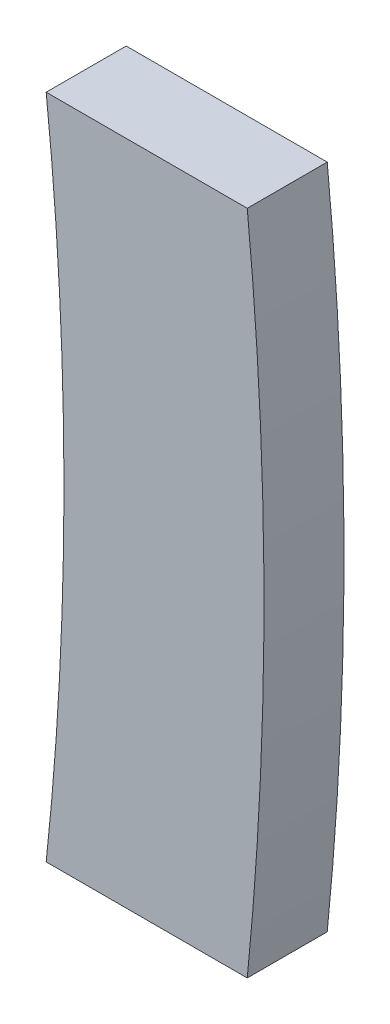
ISO-10303-21;
HEADER;
FILE_DESCRIPTION(('STEP AP214'),'2;1');
FILE_NAME('part.step','',(''),(''),'','','');
FILE_SCHEMA(('AUTOMOTIVE_DESIGN { 1 0 10303 214 1 1 1 1 }'));
ENDSEC;
DATA;
#1=APPLICATION_CONTEXT('core data for automotive mechanical design processes');
#2=APPLICATION_PROTOCOL_DEFINITION('international standard','automotive_design',2000,#1);
#3=PRODUCT_CONTEXT('',#1,'mechanical');
#4=PRODUCT('Part','Part','',(#3));
#5=PRODUCT_RELATED_PRODUCT_CATEGORY('part','',(#4));
#6=PRODUCT_DEFINITION_FORMATION('','',#4);
#7=PRODUCT_DEFINITION_CONTEXT('part definition',#1,'design');
#8=PRODUCT_DEFINITION('design','',#6,#7);
#9=PRODUCT_DEFINITION_SHAPE('','',#8);
#10=(LENGTH_UNIT() NAMED_UNIT(*) SI_UNIT(.MILLI.,.METRE.));
#11=(NAMED_UNIT(*) PLANE_ANGLE_UNIT() SI_UNIT($,.RADIAN.));
#12=(NAMED_UNIT(*) SI_UNIT($,.STERADIAN.) SOLID_ANGLE_UNIT());
#13=UNCERTAINTY_MEASURE_WITH_UNIT(LENGTH_MEASURE(1.E-05),#10,'distance_accuracy_value','');
#14=(GEOMETRIC_REPRESENTATION_CONTEXT(3) GLOBAL_UNCERTAINTY_ASSIGNED_CONTEXT((#13)) GLOBAL_UNIT_ASSIGNED_CONTEXT((#10,
#11,#12)) REPRESENTATION_CONTEXT('',''));
#15=CARTESIAN_POINT('',(0.,0.,0.));
#16=DIRECTION('',(0.,0.,1.));
#17=DIRECTION('',(1.,0.,0.));
#18=AXIS2_PLACEMENT_3D('',#15,#16,#17);
#19=CARTESIAN_POINT('',(350.01,-1.03769581311591E-13,57.));
#20=DIRECTION('',(0.,0.,1.));
#21=DIRECTION('',(1.,0.,0.));
#22=AXIS2_PLACEMENT_3D('',#19,#20,#21);
#23=PLANE('',#22);
#24=DIRECTION('',(-1.,0.,0.));
#25=VECTOR('',#24,1.);
#26=CARTESIAN_POINT('',(350.01,4.99999999999994,57.));
#27=LINE('',#26,#25);
#28=CARTESIAN_POINT('',(349.749371855331,4.99999999999994,57.));
#29=VERTEX_POINT('',#28);
#30=CARTESIAN_POINT('',(346.733285782192,5.00000000000006,57.));
#31=VERTEX_POINT('',#30);
#32=EDGE_CURVE('E11',#29,#31,#27,.T.);
#33=ORIENTED_EDGE('',*,*,#32,.T.);
#34=CARTESIAN_POINT('',(300.,0.,57.));
#35=DIRECTION('',(0.,0.,1.));
#36=DIRECTION('',(1.,0.,0.));
#37=AXIS2_PLACEMENT_3D('',#34,#35,#36);
#38=CIRCLE('',#37,47.);
#39=CARTESIAN_POINT('',(346.733285782192,-5.00000000000005,57.));
#40=VERTEX_POINT('',#39);
#41=EDGE_CURVE('E94',#31,#40,#38,.F.);
#42=ORIENTED_EDGE('',*,*,#41,.T.);
#43=DIRECTION('',(-1.,0.,0.));
#44=VECTOR('',#43,1.);
#45=CARTESIAN_POINT('',(350.01,-5.00000000000005,57.));
#46=LINE('',#45,#44);
#47=CARTESIAN_POINT('',(349.749371855331,-5.00000000000005,57.));
#48=VERTEX_POINT('',#47);
#49=EDGE_CURVE('E57',#48,#40,#46,.T.);
#50=ORIENTED_EDGE('',*,*,#49,.F.);
#51=CARTESIAN_POINT('',(300.,0.,57.));
#52=DIRECTION('',(0.,0.,1.));
#53=DIRECTION('',(1.,0.,0.));
#54=AXIS2_PLACEMENT_3D('',#51,#52,#53);
#55=CIRCLE('',#54,50.);
#56=EDGE_CURVE('E87',#29,#48,#55,.F.);
#57=ORIENTED_EDGE('',*,*,#56,.F.);
#58=EDGE_LOOP('',(#33,#42,#50,#57));
#59=FACE_BOUND('',#58,.T.);
#60=ADVANCED_FACE('F35',(#59),#23,.T.);
#61=CARTESIAN_POINT('',(350.01,4.99999999999994,55.8));
#62=DIRECTION('',(0.,1.,0.));
#63=DIRECTION('',(0.,0.,1.));
#64=AXIS2_PLACEMENT_3D('',#61,#62,#63);
#65=PLANE('',#64);
#66=DIRECTION('',(-1.,0.,0.));
#67=VECTOR('',#66,1.);
#68=CARTESIAN_POINT('',(350.01,4.99999999999994,55.8));
#69=LINE('',#68,#67);
#70=CARTESIAN_POINT('',(349.749371855331,4.99999999999994,55.8));
#71=VERTEX_POINT('',#70);
#72=CARTESIAN_POINT('',(346.733285782192,5.00000000000006,55.8));
#73=VERTEX_POINT('',#72);
#74=EDGE_CURVE('E44',#71,#73,#69,.T.);
#75=ORIENTED_EDGE('',*,*,#74,.T.);
#76=DIRECTION('',(0.,0.,1.));
#77=VECTOR('',#76,1.);
#78=CARTESIAN_POINT('',(346.733285782192,5.00000000000006,3.00000000000001));
#79=LINE('',#78,#77);
#80=EDGE_CURVE('E39',#73,#31,#79,.T.);
#81=ORIENTED_EDGE('',*,*,#80,.T.);
#82=ORIENTED_EDGE('',*,*,#32,.F.);
#83=DIRECTION('',(0.,0.,-1.));
#84=VECTOR('',#83,1.);
#85=CARTESIAN_POINT('',(349.749371855331,4.99999999999994,60.));
#86=LINE('',#85,#84);
#87=EDGE_CURVE('E103',#71,#29,#86,.F.);
#88=ORIENTED_EDGE('',*,*,#87,.F.);
#89=EDGE_LOOP('',(#75,#81,#82,#88));
#90=FACE_BOUND('',#89,.T.);
#91=ADVANCED_FACE('F101',(#90),#65,.T.);
#92=CARTESIAN_POINT('',(350.01,-5.00000000000006,55.8));
#93=DIRECTION('',(0.,-1.,0.));
#94=DIRECTION('',(0.,0.,-1.));
#95=AXIS2_PLACEMENT_3D('',#92,#93,#94);
#96=PLANE('',#95);
#97=ORIENTED_EDGE('',*,*,#49,.T.);
#98=DIRECTION('',(0.,0.,1.));
#99=VECTOR('',#98,1.);
#100=CARTESIAN_POINT('',(346.733285782192,-5.00000000000017,3.00000000000001));
#101=LINE('',#100,#99);
#102=CARTESIAN_POINT('',(346.733285782192,-5.00000000000006,55.8));
#103=VERTEX_POINT('',#102);
#104=EDGE_CURVE('E93',#40,#103,#101,.F.);
#105=ORIENTED_EDGE('',*,*,#104,.T.);
#106=DIRECTION('',(-1.,0.,0.));
#107=VECTOR('',#106,1.);
#108=CARTESIAN_POINT('',(350.01,-5.00000000000006,55.8));
#109=LINE('',#108,#107);
#110=CARTESIAN_POINT('',(349.749371855331,-5.00000000000006,55.8));
#111=VERTEX_POINT('',#110);
#112=EDGE_CURVE('E77',#111,#103,#109,.T.);
#113=ORIENTED_EDGE('',*,*,#112,.F.);
#114=DIRECTION('',(0.,0.,-1.));
#115=VECTOR('',#114,1.);
#116=CARTESIAN_POINT('',(349.749371855331,-5.00000000000005,60.));
#117=LINE('',#116,#115);
#118=EDGE_CURVE('E97',#48,#111,#117,.T.);
#119=ORIENTED_EDGE('',*,*,#118,.F.);
#120=EDGE_LOOP('',(#97,#105,#113,#119));
#121=FACE_BOUND('',#120,.T.);
#122=ADVANCED_FACE('F96',(#121),#96,.T.);
#123=CARTESIAN_POINT('',(350.01,-1.03769581311591E-13,55.8));
#124=DIRECTION('',(0.,0.,-1.));
#125=DIRECTION('',(0.,1.,0.));
#126=AXIS2_PLACEMENT_3D('',#123,#124,#125);
#127=PLANE('',#126);
#128=ORIENTED_EDGE('',*,*,#112,.T.);
#129=CARTESIAN_POINT('',(300.,0.,55.8));
#130=DIRECTION('',(0.,0.,-1.));
#131=DIRECTION('',(0.,1.,0.));
#132=AXIS2_PLACEMENT_3D('',#129,#130,#131);
#133=CIRCLE('',#132,47.);
#134=EDGE_CURVE('E80',#103,#73,#133,.F.);
#135=ORIENTED_EDGE('',*,*,#134,.T.);
#136=ORIENTED_EDGE('',*,*,#74,.F.);
#137=CARTESIAN_POINT('',(300.,0.,55.8));
#138=DIRECTION('',(0.,0.,-1.));
#139=DIRECTION('',(0.,1.,0.));
#140=AXIS2_PLACEMENT_3D('',#137,#138,#139);
#141=CIRCLE('',#140,50.);
#142=EDGE_CURVE('E82',#111,#71,#141,.F.);
#143=ORIENTED_EDGE('',*,*,#142,.F.);
#144=EDGE_LOOP('',(#128,#135,#136,#143));
#145=FACE_BOUND('',#144,.T.);
#146=ADVANCED_FACE('F79',(#145),#127,.T.);
#147=CARTESIAN_POINT('',(300.,0.,60.));
#148=DIRECTION('',(0.,0.,-1.));
#149=DIRECTION('',(-1.,0.,0.));
#150=AXIS2_PLACEMENT_3D('',#147,#148,#149);
#151=CYLINDRICAL_SURFACE('',#150,50.);
#152=ORIENTED_EDGE('',*,*,#56,.T.);
#153=ORIENTED_EDGE('',*,*,#118,.T.);
#154=ORIENTED_EDGE('',*,*,#142,.T.);
#155=ORIENTED_EDGE('',*,*,#87,.T.);
#156=EDGE_LOOP('',(#152,#153,#154,#155));
#157=FACE_BOUND('',#156,.T.);
#158=ADVANCED_FACE('F109',(#157),#151,.T.);
#159=CARTESIAN_POINT('',(300.,0.,3.));
#160=DIRECTION('',(0.,0.,1.));
#161=DIRECTION('',(1.,0.,0.));
#162=AXIS2_PLACEMENT_3D('',#159,#160,#161);
#163=CYLINDRICAL_SURFACE('',#162,47.);
#164=ORIENTED_EDGE('',*,*,#104,.F.);
#165=ORIENTED_EDGE('',*,*,#41,.F.);
#166=ORIENTED_EDGE('',*,*,#80,.F.);
#167=ORIENTED_EDGE('',*,*,#134,.F.);
#168=EDGE_LOOP('',(#164,#165,#166,#167));
#169=FACE_BOUND('',#168,.T.);
#170=ADVANCED_FACE('F37',(#169),#163,.F.);
#171=CLOSED_SHELL('',(#60,#91,#122,#146,#158,#170));
#172=MANIFOLD_SOLID_BREP('B2',#171);
#173=ADVANCED_BREP_SHAPE_REPRESENTATION('',(#18,#172),#14);
#174=SHAPE_DEFINITION_REPRESENTATION(#9,#173);
ENDSEC;
END-ISO-10303-21;
